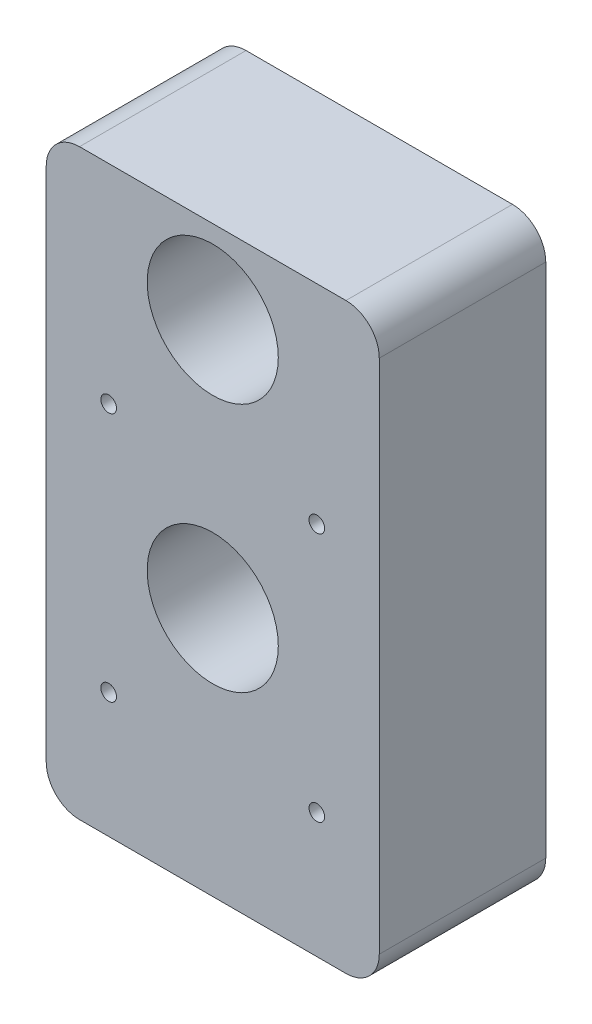
ISO-10303-21;
HEADER;
FILE_DESCRIPTION(('STEP AP214'),'2;1');
FILE_NAME('part.step','',(''),(''),'','','');
FILE_SCHEMA(('AUTOMOTIVE_DESIGN { 1 0 10303 214 1 1 1 1 }'));
ENDSEC;
DATA;
#1=APPLICATION_CONTEXT('core data for automotive mechanical design processes');
#2=APPLICATION_PROTOCOL_DEFINITION('international standard','automotive_design',2000,#1);
#3=PRODUCT_CONTEXT('',#1,'mechanical');
#4=PRODUCT('Part','Part','',(#3));
#5=PRODUCT_RELATED_PRODUCT_CATEGORY('part','',(#4));
#6=PRODUCT_DEFINITION_FORMATION('','',#4);
#7=PRODUCT_DEFINITION_CONTEXT('part definition',#1,'design');
#8=PRODUCT_DEFINITION('design','',#6,#7);
#9=PRODUCT_DEFINITION_SHAPE('','',#8);
#10=(LENGTH_UNIT() NAMED_UNIT(*) SI_UNIT(.MILLI.,.METRE.));
#11=(NAMED_UNIT(*) PLANE_ANGLE_UNIT() SI_UNIT($,.RADIAN.));
#12=(NAMED_UNIT(*) SI_UNIT($,.STERADIAN.) SOLID_ANGLE_UNIT());
#13=UNCERTAINTY_MEASURE_WITH_UNIT(LENGTH_MEASURE(1.E-05),#10,'distance_accuracy_value','');
#14=(GEOMETRIC_REPRESENTATION_CONTEXT(3) GLOBAL_UNCERTAINTY_ASSIGNED_CONTEXT((#13)) GLOBAL_UNIT_ASSIGNED_CONTEXT((#10,
#11,#12)) REPRESENTATION_CONTEXT('',''));
#15=CARTESIAN_POINT('',(0.,0.,0.));
#16=DIRECTION('',(0.,0.,1.));
#17=DIRECTION('',(1.,0.,0.));
#18=AXIS2_PLACEMENT_3D('',#15,#16,#17);
#19=CARTESIAN_POINT('',(0.,69.85,0.));
#20=DIRECTION('',(0.,0.,1.));
#21=DIRECTION('',(1.,0.,0.));
#22=AXIS2_PLACEMENT_3D('',#19,#20,#21);
#23=CYLINDRICAL_SURFACE('',#22,2.75);
#24=CARTESIAN_POINT('',(0.,69.85,0.));
#25=DIRECTION('',(0.,0.,1.));
#26=DIRECTION('',(1.,0.,0.));
#27=AXIS2_PLACEMENT_3D('',#24,#25,#26);
#28=CIRCLE('',#27,2.75);
#29=CARTESIAN_POINT('',(2.74999999999995,69.85,0.));
#30=VERTEX_POINT('',#29);
#31=EDGE_CURVE('E175',#30,#30,#28,.T.);
#32=ORIENTED_EDGE('',*,*,#31,.F.);
#33=EDGE_LOOP('',(#32));
#34=FACE_BOUND('',#33,.T.);
#35=CARTESIAN_POINT('',(0.,69.85,3.175));
#36=DIRECTION('',(0.,0.,1.));
#37=DIRECTION('',(1.,0.,0.));
#38=AXIS2_PLACEMENT_3D('',#35,#36,#37);
#39=CIRCLE('',#38,2.75);
#40=CARTESIAN_POINT('',(2.74999999999995,69.85,3.175));
#41=VERTEX_POINT('',#40);
#42=EDGE_CURVE('E170',#41,#41,#39,.F.);
#43=ORIENTED_EDGE('',*,*,#42,.F.);
#44=EDGE_LOOP('',(#43));
#45=FACE_BOUND('',#44,.T.);
#46=ADVANCED_FACE('F45',(#34,#45),#23,.F.);
#47=CARTESIAN_POINT('',(0.,50.8,0.));
#48=DIRECTION('',(0.,0.,1.));
#49=DIRECTION('',(1.,0.,0.));
#50=AXIS2_PLACEMENT_3D('',#47,#48,#49);
#51=CYLINDRICAL_SURFACE('',#50,2.75);
#52=CARTESIAN_POINT('',(0.,50.8,0.));
#53=DIRECTION('',(0.,0.,1.));
#54=DIRECTION('',(1.,0.,0.));
#55=AXIS2_PLACEMENT_3D('',#52,#53,#54);
#56=CIRCLE('',#55,2.75);
#57=CARTESIAN_POINT('',(2.74999999999995,50.8,0.));
#58=VERTEX_POINT('',#57);
#59=EDGE_CURVE('E159',#58,#58,#56,.T.);
#60=ORIENTED_EDGE('',*,*,#59,.F.);
#61=EDGE_LOOP('',(#60));
#62=FACE_BOUND('',#61,.T.);
#63=CARTESIAN_POINT('',(0.,50.8,3.175));
#64=DIRECTION('',(0.,0.,1.));
#65=DIRECTION('',(1.,0.,0.));
#66=AXIS2_PLACEMENT_3D('',#63,#64,#65);
#67=CIRCLE('',#66,2.75);
#68=CARTESIAN_POINT('',(2.74999999999995,50.8,3.175));
#69=VERTEX_POINT('',#68);
#70=EDGE_CURVE('E166',#69,#69,#67,.F.);
#71=ORIENTED_EDGE('',*,*,#70,.F.);
#72=EDGE_LOOP('',(#71));
#73=FACE_BOUND('',#72,.T.);
#74=ADVANCED_FACE('F247',(#62,#73),#51,.F.);
#75=CARTESIAN_POINT('',(-12.7,76.2,12.7));
#76=DIRECTION('',(1.,0.,0.));
#77=DIRECTION('',(0.,1.,0.));
#78=AXIS2_PLACEMENT_3D('',#75,#76,#77);
#79=PLANE('',#78);
#80=DIRECTION('',(0.,-1.,0.));
#81=VECTOR('',#80,1.);
#82=CARTESIAN_POINT('',(-12.7,76.2,0.));
#83=LINE('',#82,#81);
#84=CARTESIAN_POINT('',(-12.7,73.66,0.));
#85=VERTEX_POINT('',#84);
#86=CARTESIAN_POINT('',(-12.7,34.29,0.));
#87=VERTEX_POINT('',#86);
#88=EDGE_CURVE('E151',#85,#87,#83,.T.);
#89=ORIENTED_EDGE('',*,*,#88,.T.);
#90=DIRECTION('',(0.,0.,-1.));
#91=VECTOR('',#90,1.);
#92=CARTESIAN_POINT('',(-12.7,34.29,12.7));
#93=LINE('',#92,#91);
#94=CARTESIAN_POINT('',(-12.7,34.29,12.7));
#95=VERTEX_POINT('',#94);
#96=EDGE_CURVE('E126',#87,#95,#93,.F.);
#97=ORIENTED_EDGE('',*,*,#96,.T.);
#98=DIRECTION('',(0.,-1.,0.));
#99=VECTOR('',#98,1.);
#100=CARTESIAN_POINT('',(-12.7,76.2,12.7));
#101=LINE('',#100,#99);
#102=CARTESIAN_POINT('',(-12.7,73.66,12.7));
#103=VERTEX_POINT('',#102);
#104=EDGE_CURVE('E165',#103,#95,#101,.T.);
#105=ORIENTED_EDGE('',*,*,#104,.F.);
#106=DIRECTION('',(0.,0.,-1.));
#107=VECTOR('',#106,1.);
#108=CARTESIAN_POINT('',(-12.7,73.66,12.7));
#109=LINE('',#108,#107);
#110=EDGE_CURVE('E132',#103,#85,#109,.T.);
#111=ORIENTED_EDGE('',*,*,#110,.T.);
#112=EDGE_LOOP('',(#89,#97,#105,#111));
#113=FACE_BOUND('',#112,.T.);
#114=ADVANCED_FACE('F218',(#113),#79,.F.);
#115=CARTESIAN_POINT('',(-12.7,31.75,12.7));
#116=DIRECTION('',(0.,1.,0.));
#117=DIRECTION('',(0.,0.,1.));
#118=AXIS2_PLACEMENT_3D('',#115,#116,#117);
#119=PLANE('',#118);
#120=DIRECTION('',(1.,0.,0.));
#121=VECTOR('',#120,1.);
#122=CARTESIAN_POINT('',(-12.7,31.75,12.7));
#123=LINE('',#122,#121);
#124=CARTESIAN_POINT('',(-10.16,31.75,12.7));
#125=VERTEX_POINT('',#124);
#126=CARTESIAN_POINT('',(10.16,31.75,12.7));
#127=VERTEX_POINT('',#126);
#128=EDGE_CURVE('E142',#125,#127,#123,.T.);
#129=ORIENTED_EDGE('',*,*,#128,.F.);
#130=DIRECTION('',(0.,0.,-1.));
#131=VECTOR('',#130,1.);
#132=CARTESIAN_POINT('',(-10.16,31.75,12.7));
#133=LINE('',#132,#131);
#134=CARTESIAN_POINT('',(-10.16,31.75,0.));
#135=VERTEX_POINT('',#134);
#136=EDGE_CURVE('E125',#125,#135,#133,.T.);
#137=ORIENTED_EDGE('',*,*,#136,.T.);
#138=DIRECTION('',(1.,0.,0.));
#139=VECTOR('',#138,1.);
#140=CARTESIAN_POINT('',(-12.7,31.75,0.));
#141=LINE('',#140,#139);
#142=CARTESIAN_POINT('',(10.16,31.75,0.));
#143=VERTEX_POINT('',#142);
#144=EDGE_CURVE('E139',#135,#143,#141,.T.);
#145=ORIENTED_EDGE('',*,*,#144,.T.);
#146=DIRECTION('',(0.,0.,-1.));
#147=VECTOR('',#146,1.);
#148=CARTESIAN_POINT('',(10.16,31.75,12.7));
#149=LINE('',#148,#147);
#150=EDGE_CURVE('E145',#143,#127,#149,.F.);
#151=ORIENTED_EDGE('',*,*,#150,.T.);
#152=EDGE_LOOP('',(#129,#137,#145,#151));
#153=FACE_BOUND('',#152,.T.);
#154=ADVANCED_FACE('F138',(#153),#119,.F.);
#155=CARTESIAN_POINT('',(12.7,76.2,12.7));
#156=DIRECTION('',(-1.,0.,0.));
#157=DIRECTION('',(0.,-1.,0.));
#158=AXIS2_PLACEMENT_3D('',#155,#156,#157);
#159=PLANE('',#158);
#160=DIRECTION('',(0.,1.,0.));
#161=VECTOR('',#160,1.);
#162=CARTESIAN_POINT('',(12.7,76.2,12.7));
#163=LINE('',#162,#161);
#164=CARTESIAN_POINT('',(12.7,34.29,12.7));
#165=VERTEX_POINT('',#164);
#166=CARTESIAN_POINT('',(12.7,73.66,12.7));
#167=VERTEX_POINT('',#166);
#168=EDGE_CURVE('E224',#165,#167,#163,.T.);
#169=ORIENTED_EDGE('',*,*,#168,.F.);
#170=DIRECTION('',(0.,0.,-1.));
#171=VECTOR('',#170,1.);
#172=CARTESIAN_POINT('',(12.7,34.29,12.7));
#173=LINE('',#172,#171);
#174=CARTESIAN_POINT('',(12.7,34.29,0.));
#175=VERTEX_POINT('',#174);
#176=EDGE_CURVE('E202',#165,#175,#173,.T.);
#177=ORIENTED_EDGE('',*,*,#176,.T.);
#178=DIRECTION('',(0.,1.,0.));
#179=VECTOR('',#178,1.);
#180=CARTESIAN_POINT('',(12.7,76.2,0.));
#181=LINE('',#180,#179);
#182=CARTESIAN_POINT('',(12.7,73.66,0.));
#183=VERTEX_POINT('',#182);
#184=EDGE_CURVE('E150',#175,#183,#181,.T.);
#185=ORIENTED_EDGE('',*,*,#184,.T.);
#186=DIRECTION('',(0.,0.,-1.));
#187=VECTOR('',#186,1.);
#188=CARTESIAN_POINT('',(12.7,73.66,12.7));
#189=LINE('',#188,#187);
#190=EDGE_CURVE('E200',#183,#167,#189,.F.);
#191=ORIENTED_EDGE('',*,*,#190,.T.);
#192=EDGE_LOOP('',(#169,#177,#185,#191));
#193=FACE_BOUND('',#192,.T.);
#194=ADVANCED_FACE('F241',(#193),#159,.F.);
#195=CARTESIAN_POINT('',(-12.7,76.2,12.7));
#196=DIRECTION('',(0.,-1.,0.));
#197=DIRECTION('',(0.,0.,-1.));
#198=AXIS2_PLACEMENT_3D('',#195,#196,#197);
#199=PLANE('',#198);
#200=DIRECTION('',(-1.,0.,0.));
#201=VECTOR('',#200,1.);
#202=CARTESIAN_POINT('',(-12.7,76.2,0.));
#203=LINE('',#202,#201);
#204=CARTESIAN_POINT('',(10.16,76.2,0.));
#205=VERTEX_POINT('',#204);
#206=CARTESIAN_POINT('',(-10.16,76.2,0.));
#207=VERTEX_POINT('',#206);
#208=EDGE_CURVE('E156',#205,#207,#203,.T.);
#209=ORIENTED_EDGE('',*,*,#208,.T.);
#210=DIRECTION('',(0.,0.,-1.));
#211=VECTOR('',#210,1.);
#212=CARTESIAN_POINT('',(-10.16,76.2,12.7));
#213=LINE('',#212,#211);
#214=CARTESIAN_POINT('',(-10.16,76.2,12.7));
#215=VERTEX_POINT('',#214);
#216=EDGE_CURVE('E12',#207,#215,#213,.F.);
#217=ORIENTED_EDGE('',*,*,#216,.T.);
#218=DIRECTION('',(-1.,0.,0.));
#219=VECTOR('',#218,1.);
#220=CARTESIAN_POINT('',(-12.7,76.2,12.7));
#221=LINE('',#220,#219);
#222=CARTESIAN_POINT('',(10.16,76.2,12.7));
#223=VERTEX_POINT('',#222);
#224=EDGE_CURVE('E177',#223,#215,#221,.T.);
#225=ORIENTED_EDGE('',*,*,#224,.F.);
#226=DIRECTION('',(0.,0.,-1.));
#227=VECTOR('',#226,1.);
#228=CARTESIAN_POINT('',(10.16,76.2,12.7));
#229=LINE('',#228,#227);
#230=EDGE_CURVE('E54',#223,#205,#229,.T.);
#231=ORIENTED_EDGE('',*,*,#230,.T.);
#232=EDGE_LOOP('',(#209,#217,#225,#231));
#233=FACE_BOUND('',#232,.T.);
#234=ADVANCED_FACE('F210',(#233),#199,.F.);
#235=CARTESIAN_POINT('',(0.,0.,12.7));
#236=DIRECTION('',(0.,0.,1.));
#237=DIRECTION('',(1.,0.,0.));
#238=AXIS2_PLACEMENT_3D('',#235,#236,#237);
#239=PLANE('',#238);
#240=CARTESIAN_POINT('',(7.93749999999992,60.3249999999999,12.7));
#241=DIRECTION('',(0.,0.,1.));
#242=DIRECTION('',(1.,0.,0.));
#243=AXIS2_PLACEMENT_3D('',#240,#241,#242);
#244=CIRCLE('',#243,0.595312499999999);
#245=CARTESIAN_POINT('',(8.53281249999992,60.3249999999999,12.7));
#246=VERTEX_POINT('',#245);
#247=EDGE_CURVE('E315',#246,#246,#244,.T.);
#248=ORIENTED_EDGE('',*,*,#247,.F.);
#249=EDGE_LOOP('',(#248));
#250=FACE_BOUND('',#249,.T.);
#251=CARTESIAN_POINT('',(-7.93750000000008,60.325,12.7));
#252=DIRECTION('',(0.,0.,1.));
#253=DIRECTION('',(1.,0.,0.));
#254=AXIS2_PLACEMENT_3D('',#251,#252,#253);
#255=CIRCLE('',#254,0.5953125);
#256=CARTESIAN_POINT('',(-7.34218750000008,60.325,12.7));
#257=VERTEX_POINT('',#256);
#258=EDGE_CURVE('E305',#257,#257,#255,.T.);
#259=ORIENTED_EDGE('',*,*,#258,.F.);
#260=EDGE_LOOP('',(#259));
#261=FACE_BOUND('',#260,.T.);
#262=CARTESIAN_POINT('',(-7.93750000000005,41.275,12.7));
#263=DIRECTION('',(0.,0.,1.));
#264=DIRECTION('',(1.,0.,0.));
#265=AXIS2_PLACEMENT_3D('',#262,#263,#264);
#266=CIRCLE('',#265,0.5953125);
#267=CARTESIAN_POINT('',(-7.34218750000004,41.275,12.7));
#268=VERTEX_POINT('',#267);
#269=EDGE_CURVE('E295',#268,#268,#266,.T.);
#270=ORIENTED_EDGE('',*,*,#269,.F.);
#271=EDGE_LOOP('',(#270));
#272=FACE_BOUND('',#271,.T.);
#273=CARTESIAN_POINT('',(7.93749999999995,41.2749999999999,12.7));
#274=DIRECTION('',(0.,0.,1.));
#275=DIRECTION('',(1.,0.,0.));
#276=AXIS2_PLACEMENT_3D('',#273,#274,#275);
#277=CIRCLE('',#276,0.595312499999999);
#278=CARTESIAN_POINT('',(8.53281249999995,41.2749999999999,12.7));
#279=VERTEX_POINT('',#278);
#280=EDGE_CURVE('E298',#279,#279,#277,.T.);
#281=ORIENTED_EDGE('',*,*,#280,.F.);
#282=EDGE_LOOP('',(#281));
#283=FACE_BOUND('',#282,.T.);
#284=CARTESIAN_POINT('',(0.,50.8,12.7));
#285=DIRECTION('',(0.,0.,1.));
#286=DIRECTION('',(1.,0.,0.));
#287=AXIS2_PLACEMENT_3D('',#284,#285,#286);
#288=CIRCLE('',#287,5.);
#289=CARTESIAN_POINT('',(4.99999999999995,50.8,12.7));
#290=VERTEX_POINT('',#289);
#291=EDGE_CURVE('E326',#290,#290,#288,.T.);
#292=ORIENTED_EDGE('',*,*,#291,.F.);
#293=EDGE_LOOP('',(#292));
#294=FACE_BOUND('',#293,.T.);
#295=CARTESIAN_POINT('',(0.,69.85,12.7));
#296=DIRECTION('',(0.,0.,1.));
#297=DIRECTION('',(1.,0.,0.));
#298=AXIS2_PLACEMENT_3D('',#295,#296,#297);
#299=CIRCLE('',#298,5.);
#300=CARTESIAN_POINT('',(4.99999999999995,69.85,12.7));
#301=VERTEX_POINT('',#300);
#302=EDGE_CURVE('E330',#301,#301,#299,.T.);
#303=ORIENTED_EDGE('',*,*,#302,.F.);
#304=EDGE_LOOP('',(#303));
#305=FACE_BOUND('',#304,.T.);
#306=ORIENTED_EDGE('',*,*,#104,.T.);
#307=CARTESIAN_POINT('',(-10.16,34.29,12.7));
#308=DIRECTION('',(0.,0.,1.));
#309=DIRECTION('',(1.,0.,0.));
#310=AXIS2_PLACEMENT_3D('',#307,#308,#309);
#311=CIRCLE('',#310,2.54);
#312=EDGE_CURVE('E197',#95,#125,#311,.T.);
#313=ORIENTED_EDGE('',*,*,#312,.T.);
#314=ORIENTED_EDGE('',*,*,#128,.T.);
#315=CARTESIAN_POINT('',(10.16,34.29,12.7));
#316=DIRECTION('',(0.,0.,1.));
#317=DIRECTION('',(1.,0.,0.));
#318=AXIS2_PLACEMENT_3D('',#315,#316,#317);
#319=CIRCLE('',#318,2.54);
#320=EDGE_CURVE('E194',#127,#165,#319,.T.);
#321=ORIENTED_EDGE('',*,*,#320,.T.);
#322=ORIENTED_EDGE('',*,*,#168,.T.);
#323=CARTESIAN_POINT('',(10.16,73.66,12.7));
#324=DIRECTION('',(0.,0.,1.));
#325=DIRECTION('',(1.,0.,0.));
#326=AXIS2_PLACEMENT_3D('',#323,#324,#325);
#327=CIRCLE('',#326,2.54);
#328=EDGE_CURVE('E66',#167,#223,#327,.T.);
#329=ORIENTED_EDGE('',*,*,#328,.T.);
#330=ORIENTED_EDGE('',*,*,#224,.T.);
#331=CARTESIAN_POINT('',(-10.16,73.66,12.7));
#332=DIRECTION('',(0.,0.,1.));
#333=DIRECTION('',(1.,0.,0.));
#334=AXIS2_PLACEMENT_3D('',#331,#332,#333);
#335=CIRCLE('',#334,2.54);
#336=EDGE_CURVE('E192',#215,#103,#335,.T.);
#337=ORIENTED_EDGE('',*,*,#336,.T.);
#338=EDGE_LOOP('',(#306,#313,#314,#321,#322,#329,#330,#337));
#339=FACE_BOUND('',#338,.T.);
#340=ADVANCED_FACE('F230',(#250,#261,#272,#283,#294,#305,#339),#239,.T.);
#341=CARTESIAN_POINT('',(0.,0.,0.));
#342=DIRECTION('',(0.,0.,1.));
#343=DIRECTION('',(1.,0.,0.));
#344=AXIS2_PLACEMENT_3D('',#341,#342,#343);
#345=PLANE('',#344);
#346=CARTESIAN_POINT('',(7.93749999999992,60.3249999999999,0.));
#347=DIRECTION('',(0.,0.,1.));
#348=DIRECTION('',(1.,0.,0.));
#349=AXIS2_PLACEMENT_3D('',#346,#347,#348);
#350=CIRCLE('',#349,0.595312499999999);
#351=CARTESIAN_POINT('',(8.53281249999992,60.3249999999999,0.));
#352=VERTEX_POINT('',#351);
#353=EDGE_CURVE('E318',#352,#352,#350,.T.);
#354=ORIENTED_EDGE('',*,*,#353,.T.);
#355=EDGE_LOOP('',(#354));
#356=FACE_BOUND('',#355,.T.);
#357=CARTESIAN_POINT('',(-7.93750000000008,60.325,0.));
#358=DIRECTION('',(0.,0.,1.));
#359=DIRECTION('',(1.,0.,0.));
#360=AXIS2_PLACEMENT_3D('',#357,#358,#359);
#361=CIRCLE('',#360,0.5953125);
#362=CARTESIAN_POINT('',(-7.34218750000008,60.325,0.));
#363=VERTEX_POINT('',#362);
#364=EDGE_CURVE('E311',#363,#363,#361,.T.);
#365=ORIENTED_EDGE('',*,*,#364,.T.);
#366=EDGE_LOOP('',(#365));
#367=FACE_BOUND('',#366,.T.);
#368=CARTESIAN_POINT('',(-7.93750000000005,41.275,0.));
#369=DIRECTION('',(0.,0.,1.));
#370=DIRECTION('',(1.,0.,0.));
#371=AXIS2_PLACEMENT_3D('',#368,#369,#370);
#372=CIRCLE('',#371,0.5953125);
#373=CARTESIAN_POINT('',(-7.34218750000004,41.275,0.));
#374=VERTEX_POINT('',#373);
#375=EDGE_CURVE('E292',#374,#374,#372,.T.);
#376=ORIENTED_EDGE('',*,*,#375,.T.);
#377=EDGE_LOOP('',(#376));
#378=FACE_BOUND('',#377,.T.);
#379=CARTESIAN_POINT('',(7.93749999999995,41.2749999999999,0.));
#380=DIRECTION('',(0.,0.,1.));
#381=DIRECTION('',(1.,0.,0.));
#382=AXIS2_PLACEMENT_3D('',#379,#380,#381);
#383=CIRCLE('',#382,0.595312499999999);
#384=CARTESIAN_POINT('',(8.53281249999995,41.2749999999999,0.));
#385=VERTEX_POINT('',#384);
#386=EDGE_CURVE('E303',#385,#385,#383,.T.);
#387=ORIENTED_EDGE('',*,*,#386,.T.);
#388=EDGE_LOOP('',(#387));
#389=FACE_BOUND('',#388,.T.);
#390=ORIENTED_EDGE('',*,*,#59,.T.);
#391=EDGE_LOOP('',(#390));
#392=FACE_BOUND('',#391,.T.);
#393=ORIENTED_EDGE('',*,*,#31,.T.);
#394=EDGE_LOOP('',(#393));
#395=FACE_BOUND('',#394,.T.);
#396=ORIENTED_EDGE('',*,*,#144,.F.);
#397=CARTESIAN_POINT('',(-10.16,34.29,0.));
#398=DIRECTION('',(0.,0.,1.));
#399=DIRECTION('',(1.,0.,0.));
#400=AXIS2_PLACEMENT_3D('',#397,#398,#399);
#401=CIRCLE('',#400,2.54);
#402=EDGE_CURVE('E121',#135,#87,#401,.F.);
#403=ORIENTED_EDGE('',*,*,#402,.T.);
#404=ORIENTED_EDGE('',*,*,#88,.F.);
#405=CARTESIAN_POINT('',(-10.16,73.66,0.));
#406=DIRECTION('',(0.,0.,1.));
#407=DIRECTION('',(1.,0.,0.));
#408=AXIS2_PLACEMENT_3D('',#405,#406,#407);
#409=CIRCLE('',#408,2.54);
#410=EDGE_CURVE('E181',#85,#207,#409,.F.);
#411=ORIENTED_EDGE('',*,*,#410,.T.);
#412=ORIENTED_EDGE('',*,*,#208,.F.);
#413=CARTESIAN_POINT('',(10.16,73.66,0.));
#414=DIRECTION('',(0.,0.,1.));
#415=DIRECTION('',(1.,0.,0.));
#416=AXIS2_PLACEMENT_3D('',#413,#414,#415);
#417=CIRCLE('',#416,2.54);
#418=EDGE_CURVE('E144',#205,#183,#417,.F.);
#419=ORIENTED_EDGE('',*,*,#418,.T.);
#420=ORIENTED_EDGE('',*,*,#184,.F.);
#421=CARTESIAN_POINT('',(10.16,34.29,0.));
#422=DIRECTION('',(0.,0.,1.));
#423=DIRECTION('',(1.,0.,0.));
#424=AXIS2_PLACEMENT_3D('',#421,#422,#423);
#425=CIRCLE('',#424,2.54);
#426=EDGE_CURVE('E133',#175,#143,#425,.F.);
#427=ORIENTED_EDGE('',*,*,#426,.T.);
#428=EDGE_LOOP('',(#396,#403,#404,#411,#412,#419,#420,#427));
#429=FACE_BOUND('',#428,.T.);
#430=ADVANCED_FACE('F147',(#356,#367,#378,#389,#392,#395,#429),#345,.F.);
#431=CARTESIAN_POINT('',(0.,0.,3.175));
#432=DIRECTION('',(0.,0.,1.));
#433=DIRECTION('',(1.,0.,0.));
#434=AXIS2_PLACEMENT_3D('',#431,#432,#433);
#435=PLANE('',#434);
#436=CARTESIAN_POINT('',(0.,50.8,3.175));
#437=DIRECTION('',(0.,0.,1.));
#438=DIRECTION('',(1.,0.,0.));
#439=AXIS2_PLACEMENT_3D('',#436,#437,#438);
#440=CIRCLE('',#439,5.);
#441=CARTESIAN_POINT('',(4.99999999999995,50.8,3.175));
#442=VERTEX_POINT('',#441);
#443=EDGE_CURVE('E171',#442,#442,#440,.F.);
#444=ORIENTED_EDGE('',*,*,#443,.F.);
#445=EDGE_LOOP('',(#444));
#446=FACE_BOUND('',#445,.T.);
#447=ORIENTED_EDGE('',*,*,#70,.T.);
#448=EDGE_LOOP('',(#447));
#449=FACE_BOUND('',#448,.T.);
#450=ADVANCED_FACE('F238',(#446,#449),#435,.T.);
#451=CARTESIAN_POINT('',(0.,50.8,-14.142135623731));
#452=DIRECTION('',(0.,0.,1.));
#453=DIRECTION('',(1.,0.,0.));
#454=AXIS2_PLACEMENT_3D('',#451,#452,#453);
#455=CYLINDRICAL_SURFACE('',#454,5.);
#456=ORIENTED_EDGE('',*,*,#443,.T.);
#457=EDGE_LOOP('',(#456));
#458=FACE_BOUND('',#457,.T.);
#459=ORIENTED_EDGE('',*,*,#291,.T.);
#460=EDGE_LOOP('',(#459));
#461=FACE_BOUND('',#460,.T.);
#462=ADVANCED_FACE('F261',(#458,#461),#455,.F.);
#463=CARTESIAN_POINT('',(0.,0.,3.175));
#464=DIRECTION('',(0.,0.,1.));
#465=DIRECTION('',(1.,0.,0.));
#466=AXIS2_PLACEMENT_3D('',#463,#464,#465);
#467=PLANE('',#466);
#468=CARTESIAN_POINT('',(0.,69.85,3.175));
#469=DIRECTION('',(0.,0.,1.));
#470=DIRECTION('',(1.,0.,0.));
#471=AXIS2_PLACEMENT_3D('',#468,#469,#470);
#472=CIRCLE('',#471,5.);
#473=CARTESIAN_POINT('',(4.99999999999995,69.85,3.175));
#474=VERTEX_POINT('',#473);
#475=EDGE_CURVE('E324',#474,#474,#472,.F.);
#476=ORIENTED_EDGE('',*,*,#475,.F.);
#477=EDGE_LOOP('',(#476));
#478=FACE_BOUND('',#477,.T.);
#479=ORIENTED_EDGE('',*,*,#42,.T.);
#480=EDGE_LOOP('',(#479));
#481=FACE_BOUND('',#480,.T.);
#482=ADVANCED_FACE('F257',(#478,#481),#467,.T.);
#483=CARTESIAN_POINT('',(0.,69.85,-14.142135623731));
#484=DIRECTION('',(0.,0.,1.));
#485=DIRECTION('',(1.,0.,0.));
#486=AXIS2_PLACEMENT_3D('',#483,#484,#485);
#487=CYLINDRICAL_SURFACE('',#486,5.);
#488=ORIENTED_EDGE('',*,*,#475,.T.);
#489=EDGE_LOOP('',(#488));
#490=FACE_BOUND('',#489,.T.);
#491=ORIENTED_EDGE('',*,*,#302,.T.);
#492=EDGE_LOOP('',(#491));
#493=FACE_BOUND('',#492,.T.);
#494=ADVANCED_FACE('F260',(#490,#493),#487,.F.);
#495=CARTESIAN_POINT('',(7.93749999999995,41.2749999999999,0.));
#496=DIRECTION('',(0.,0.,1.));
#497=DIRECTION('',(1.,0.,0.));
#498=AXIS2_PLACEMENT_3D('',#495,#496,#497);
#499=CYLINDRICAL_SURFACE('',#498,0.595312499999999);
#500=ORIENTED_EDGE('',*,*,#386,.F.);
#501=EDGE_LOOP('',(#500));
#502=FACE_BOUND('',#501,.T.);
#503=ORIENTED_EDGE('',*,*,#280,.T.);
#504=EDGE_LOOP('',(#503));
#505=FACE_BOUND('',#504,.T.);
#506=ADVANCED_FACE('F265',(#502,#505),#499,.F.);
#507=CARTESIAN_POINT('',(-7.93750000000005,41.275,0.));
#508=DIRECTION('',(0.,0.,1.));
#509=DIRECTION('',(1.,0.,0.));
#510=AXIS2_PLACEMENT_3D('',#507,#508,#509);
#511=CYLINDRICAL_SURFACE('',#510,0.5953125);
#512=ORIENTED_EDGE('',*,*,#375,.F.);
#513=EDGE_LOOP('',(#512));
#514=FACE_BOUND('',#513,.T.);
#515=ORIENTED_EDGE('',*,*,#269,.T.);
#516=EDGE_LOOP('',(#515));
#517=FACE_BOUND('',#516,.T.);
#518=ADVANCED_FACE('F275',(#514,#517),#511,.F.);
#519=CARTESIAN_POINT('',(-7.93750000000008,60.325,0.));
#520=DIRECTION('',(0.,0.,1.));
#521=DIRECTION('',(1.,0.,0.));
#522=AXIS2_PLACEMENT_3D('',#519,#520,#521);
#523=CYLINDRICAL_SURFACE('',#522,0.5953125);
#524=ORIENTED_EDGE('',*,*,#364,.F.);
#525=EDGE_LOOP('',(#524));
#526=FACE_BOUND('',#525,.T.);
#527=ORIENTED_EDGE('',*,*,#258,.T.);
#528=EDGE_LOOP('',(#527));
#529=FACE_BOUND('',#528,.T.);
#530=ADVANCED_FACE('F280',(#526,#529),#523,.F.);
#531=CARTESIAN_POINT('',(7.93749999999992,60.3249999999999,0.));
#532=DIRECTION('',(0.,0.,1.));
#533=DIRECTION('',(1.,0.,0.));
#534=AXIS2_PLACEMENT_3D('',#531,#532,#533);
#535=CYLINDRICAL_SURFACE('',#534,0.595312499999999);
#536=ORIENTED_EDGE('',*,*,#353,.F.);
#537=EDGE_LOOP('',(#536));
#538=FACE_BOUND('',#537,.T.);
#539=ORIENTED_EDGE('',*,*,#247,.T.);
#540=EDGE_LOOP('',(#539));
#541=FACE_BOUND('',#540,.T.);
#542=ADVANCED_FACE('F277',(#538,#541),#535,.F.);
#543=CARTESIAN_POINT('',(-10.16,34.29,12.7));
#544=DIRECTION('',(0.,0.,-1.));
#545=DIRECTION('',(-1.,0.,0.));
#546=AXIS2_PLACEMENT_3D('',#543,#544,#545);
#547=CYLINDRICAL_SURFACE('',#546,2.54);
#548=ORIENTED_EDGE('',*,*,#312,.F.);
#549=ORIENTED_EDGE('',*,*,#96,.F.);
#550=ORIENTED_EDGE('',*,*,#402,.F.);
#551=ORIENTED_EDGE('',*,*,#136,.F.);
#552=EDGE_LOOP('',(#548,#549,#550,#551));
#553=FACE_BOUND('',#552,.T.);
#554=ADVANCED_FACE('F124',(#553),#547,.T.);
#555=CARTESIAN_POINT('',(10.16,34.29,12.7));
#556=DIRECTION('',(0.,0.,-1.));
#557=DIRECTION('',(-1.,0.,0.));
#558=AXIS2_PLACEMENT_3D('',#555,#556,#557);
#559=CYLINDRICAL_SURFACE('',#558,2.54);
#560=ORIENTED_EDGE('',*,*,#320,.F.);
#561=ORIENTED_EDGE('',*,*,#150,.F.);
#562=ORIENTED_EDGE('',*,*,#426,.F.);
#563=ORIENTED_EDGE('',*,*,#176,.F.);
#564=EDGE_LOOP('',(#560,#561,#562,#563));
#565=FACE_BOUND('',#564,.T.);
#566=ADVANCED_FACE('F386',(#565),#559,.T.);
#567=CARTESIAN_POINT('',(-10.16,73.66,12.7));
#568=DIRECTION('',(0.,0.,-1.));
#569=DIRECTION('',(-1.,0.,0.));
#570=AXIS2_PLACEMENT_3D('',#567,#568,#569);
#571=CYLINDRICAL_SURFACE('',#570,2.54);
#572=ORIENTED_EDGE('',*,*,#336,.F.);
#573=ORIENTED_EDGE('',*,*,#216,.F.);
#574=ORIENTED_EDGE('',*,*,#410,.F.);
#575=ORIENTED_EDGE('',*,*,#110,.F.);
#576=EDGE_LOOP('',(#572,#573,#574,#575));
#577=FACE_BOUND('',#576,.T.);
#578=ADVANCED_FACE('F215',(#577),#571,.T.);
#579=CARTESIAN_POINT('',(10.16,73.66,12.7));
#580=DIRECTION('',(0.,0.,-1.));
#581=DIRECTION('',(-1.,0.,0.));
#582=AXIS2_PLACEMENT_3D('',#579,#580,#581);
#583=CYLINDRICAL_SURFACE('',#582,2.54);
#584=ORIENTED_EDGE('',*,*,#328,.F.);
#585=ORIENTED_EDGE('',*,*,#190,.F.);
#586=ORIENTED_EDGE('',*,*,#418,.F.);
#587=ORIENTED_EDGE('',*,*,#230,.F.);
#588=EDGE_LOOP('',(#584,#585,#586,#587));
#589=FACE_BOUND('',#588,.T.);
#590=ADVANCED_FACE('F47',(#589),#583,.T.);
#591=CLOSED_SHELL('',(#46,#74,#114,#154,#194,#234,#340,#430,#450,#462,#482,#494,#506,#518,#530,
#542,#554,#566,#578,#590));
#592=MANIFOLD_SOLID_BREP('B2',#591);
#593=ADVANCED_BREP_SHAPE_REPRESENTATION('',(#18,#592),#14);
#594=SHAPE_DEFINITION_REPRESENTATION(#9,#593);
ENDSEC;
END-ISO-10303-21;
